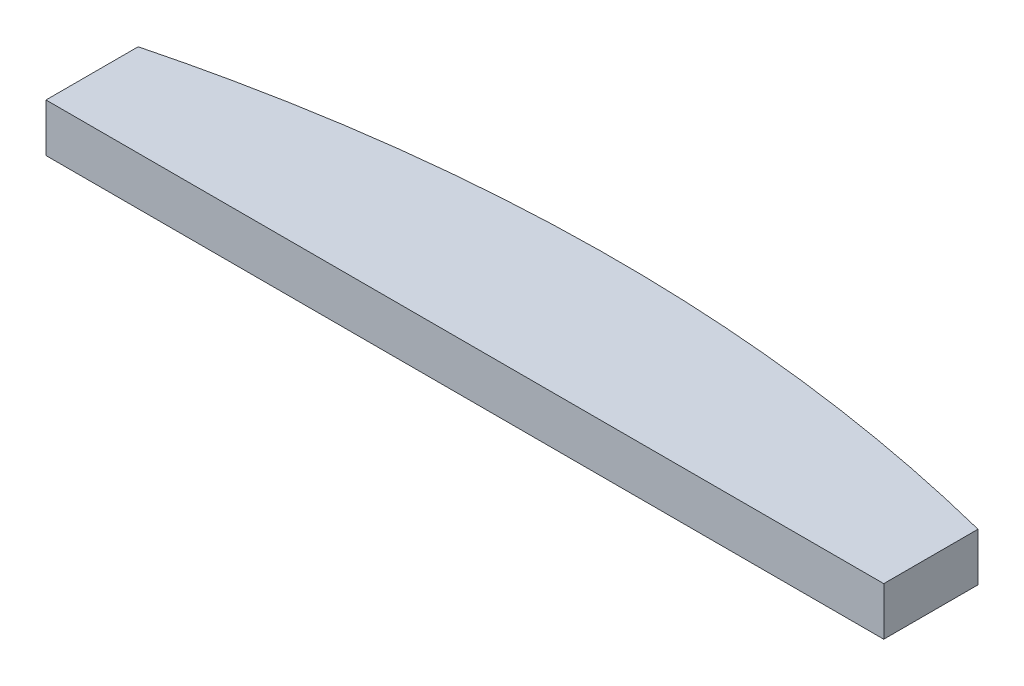
ISO-10303-21;
HEADER;
FILE_DESCRIPTION(('STEP AP214'),'2;1');
FILE_NAME('part.step','',(''),(''),'','','');
FILE_SCHEMA(('AUTOMOTIVE_DESIGN { 1 0 10303 214 1 1 1 1 }'));
ENDSEC;
DATA;
#1=APPLICATION_CONTEXT('core data for automotive mechanical design processes');
#2=APPLICATION_PROTOCOL_DEFINITION('international standard','automotive_design',2000,#1);
#3=PRODUCT_CONTEXT('',#1,'mechanical');
#4=PRODUCT('Part','Part','',(#3));
#5=PRODUCT_RELATED_PRODUCT_CATEGORY('part','',(#4));
#6=PRODUCT_DEFINITION_FORMATION('','',#4);
#7=PRODUCT_DEFINITION_CONTEXT('part definition',#1,'design');
#8=PRODUCT_DEFINITION('design','',#6,#7);
#9=PRODUCT_DEFINITION_SHAPE('','',#8);
#10=(LENGTH_UNIT() NAMED_UNIT(*) SI_UNIT(.MILLI.,.METRE.));
#11=(NAMED_UNIT(*) PLANE_ANGLE_UNIT() SI_UNIT($,.RADIAN.));
#12=(NAMED_UNIT(*) SI_UNIT($,.STERADIAN.) SOLID_ANGLE_UNIT());
#13=UNCERTAINTY_MEASURE_WITH_UNIT(LENGTH_MEASURE(1.E-05),#10,'distance_accuracy_value','');
#14=(GEOMETRIC_REPRESENTATION_CONTEXT(3) GLOBAL_UNCERTAINTY_ASSIGNED_CONTEXT((#13)) GLOBAL_UNIT_ASSIGNED_CONTEXT((#10,
#11,#12)) REPRESENTATION_CONTEXT('',''));
#15=CARTESIAN_POINT('',(0.,0.,0.));
#16=DIRECTION('',(0.,0.,1.));
#17=DIRECTION('',(1.,0.,0.));
#18=AXIS2_PLACEMENT_3D('',#15,#16,#17);
#19=CARTESIAN_POINT('',(-187.80820486291,2.921,-68.9201978060008));
#20=DIRECTION('',(0.,1.,0.));
#21=DIRECTION('',(0.,0.,1.));
#22=AXIS2_PLACEMENT_3D('',#19,#20,#21);
#23=PLANE('',#22);
#24=DIRECTION('',(0.,0.,1.));
#25=VECTOR('',#24,1.);
#26=CARTESIAN_POINT('',(-213.200238169666,2.921,-60.0302174041435));
#27=LINE('',#26,#25);
#28=CARTESIAN_POINT('',(-213.200238169666,2.921,-65.6182174041435));
#29=VERTEX_POINT('',#28);
#30=CARTESIAN_POINT('',(-213.200238169666,2.921,-60.0302174041435));
#31=VERTEX_POINT('',#30);
#32=EDGE_CURVE('E13',#29,#31,#27,.T.);
#33=ORIENTED_EDGE('',*,*,#32,.T.);
#34=DIRECTION('',(1.,0.,0.));
#35=VECTOR('',#34,1.);
#36=CARTESIAN_POINT('',(-213.200238169666,2.921,-60.0302174041435));
#37=LINE('',#36,#35);
#38=CARTESIAN_POINT('',(-162.400238169666,2.921,-60.0302174041435));
#39=VERTEX_POINT('',#38);
#40=EDGE_CURVE('E82',#31,#39,#37,.T.);
#41=ORIENTED_EDGE('',*,*,#40,.T.);
#42=DIRECTION('',(0.,0.,-1.));
#43=VECTOR('',#42,1.);
#44=CARTESIAN_POINT('',(-162.400238169666,2.921,-60.0302174041435));
#45=LINE('',#44,#43);
#46=CARTESIAN_POINT('',(-162.400238169666,2.921,-65.7452174041435));
#47=VERTEX_POINT('',#46);
#48=EDGE_CURVE('E123',#39,#47,#45,.T.);
#49=ORIENTED_EDGE('',*,*,#48,.T.);
#50=CARTESIAN_POINT('',(-162.400238169666,2.921,-65.7452174041435));
#51=CARTESIAN_POINT('',(-187.816171556154,2.921,-72.158678207858));
#52=CARTESIAN_POINT('',(-213.200238169666,2.921,-65.6182174041436));
#53=B_SPLINE_CURVE_WITH_KNOTS('',2,(#50,#51,#52),.UNSPECIFIED.,.F.,.F.,(3,3),(0.,1.),.UNSPECIFIED.);
#54=EDGE_CURVE('E145',#47,#29,#53,.T.);
#55=ORIENTED_EDGE('',*,*,#54,.T.);
#56=EDGE_LOOP('',(#33,#41,#49,#55));
#57=FACE_BOUND('',#56,.T.);
#58=ADVANCED_FACE('F73',(#57),#23,.T.);
#59=CARTESIAN_POINT('',(-213.200238169666,0.,-65.6182174041436));
#60=CARTESIAN_POINT('',(-187.816171556154,0.,-72.158678207858));
#61=CARTESIAN_POINT('',(-162.400238169666,0.,-65.7452174041435));
#62=B_SPLINE_CURVE_WITH_KNOTS('',2,(#59,#60,#61),.UNSPECIFIED.,.F.,.F.,(3,3),(0.,1.),.UNSPECIFIED.);
#63=DIRECTION('',(0.,1.,0.));
#64=VECTOR('',#63,1.);
#65=SURFACE_OF_LINEAR_EXTRUSION('',#62,#64);
#66=ORIENTED_EDGE('',*,*,#54,.F.);
#67=DIRECTION('',(0.,1.,0.));
#68=VECTOR('',#67,1.);
#69=CARTESIAN_POINT('',(-162.400238169666,0.,-65.7452174041435));
#70=LINE('',#69,#68);
#71=CARTESIAN_POINT('',(-162.400238169666,0.,-65.7452174041435));
#72=VERTEX_POINT('',#71);
#73=EDGE_CURVE('E127',#72,#47,#70,.T.);
#74=ORIENTED_EDGE('',*,*,#73,.F.);
#75=CARTESIAN_POINT('',(-213.200238169666,0.,-65.6182174041435));
#76=VERTEX_POINT('',#75);
#77=EDGE_CURVE('E89',#76,#72,#62,.T.);
#78=ORIENTED_EDGE('',*,*,#77,.F.);
#79=DIRECTION('',(0.,1.,0.));
#80=VECTOR('',#79,1.);
#81=CARTESIAN_POINT('',(-213.200238169666,0.,-65.6182174041435));
#82=LINE('',#81,#80);
#83=EDGE_CURVE('E138',#76,#29,#82,.T.);
#84=ORIENTED_EDGE('',*,*,#83,.T.);
#85=EDGE_LOOP('',(#66,#74,#78,#84));
#86=FACE_BOUND('',#85,.T.);
#87=ADVANCED_FACE('F161',(#86),#65,.F.);
#88=CARTESIAN_POINT('',(-162.400238169666,0.,0.));
#89=DIRECTION('',(1.,0.,0.));
#90=DIRECTION('',(0.,0.,-1.));
#91=AXIS2_PLACEMENT_3D('',#88,#89,#90);
#92=PLANE('',#91);
#93=DIRECTION('',(0.,1.,0.));
#94=VECTOR('',#93,1.);
#95=CARTESIAN_POINT('',(-162.400238169666,0.,-60.0302174041435));
#96=LINE('',#95,#94);
#97=CARTESIAN_POINT('',(-162.400238169666,0.,-60.0302174041435));
#98=VERTEX_POINT('',#97);
#99=EDGE_CURVE('E116',#98,#39,#96,.T.);
#100=ORIENTED_EDGE('',*,*,#99,.F.);
#101=DIRECTION('',(0.,0.,-1.));
#102=VECTOR('',#101,1.);
#103=CARTESIAN_POINT('',(-162.400238169666,0.,0.));
#104=LINE('',#103,#102);
#105=EDGE_CURVE('E121',#98,#72,#104,.T.);
#106=ORIENTED_EDGE('',*,*,#105,.T.);
#107=ORIENTED_EDGE('',*,*,#73,.T.);
#108=ORIENTED_EDGE('',*,*,#48,.F.);
#109=EDGE_LOOP('',(#100,#106,#107,#108));
#110=FACE_BOUND('',#109,.T.);
#111=ADVANCED_FACE('F118',(#110),#92,.T.);
#112=CARTESIAN_POINT('',(0.,0.,-60.0302174041435));
#113=DIRECTION('',(0.,0.,1.));
#114=DIRECTION('',(1.,0.,0.));
#115=AXIS2_PLACEMENT_3D('',#112,#113,#114);
#116=PLANE('',#115);
#117=DIRECTION('',(0.,1.,0.));
#118=VECTOR('',#117,1.);
#119=CARTESIAN_POINT('',(-213.200238169666,0.,-60.0302174041435));
#120=LINE('',#119,#118);
#121=CARTESIAN_POINT('',(-213.200238169666,0.,-60.0302174041435));
#122=VERTEX_POINT('',#121);
#123=EDGE_CURVE('E97',#122,#31,#120,.T.);
#124=ORIENTED_EDGE('',*,*,#123,.F.);
#125=DIRECTION('',(1.,0.,0.));
#126=VECTOR('',#125,1.);
#127=CARTESIAN_POINT('',(0.,0.,-60.0302174041435));
#128=LINE('',#127,#126);
#129=EDGE_CURVE('E130',#122,#98,#128,.T.);
#130=ORIENTED_EDGE('',*,*,#129,.T.);
#131=ORIENTED_EDGE('',*,*,#99,.T.);
#132=ORIENTED_EDGE('',*,*,#40,.F.);
#133=EDGE_LOOP('',(#124,#130,#131,#132));
#134=FACE_BOUND('',#133,.T.);
#135=ADVANCED_FACE('F131',(#134),#116,.T.);
#136=CARTESIAN_POINT('',(-213.200238169666,0.,0.));
#137=DIRECTION('',(1.,0.,0.));
#138=DIRECTION('',(0.,0.,-1.));
#139=AXIS2_PLACEMENT_3D('',#136,#137,#138);
#140=PLANE('',#139);
#141=ORIENTED_EDGE('',*,*,#32,.F.);
#142=ORIENTED_EDGE('',*,*,#83,.F.);
#143=DIRECTION('',(0.,0.,-1.));
#144=VECTOR('',#143,1.);
#145=CARTESIAN_POINT('',(-213.200238169666,0.,0.));
#146=LINE('',#145,#144);
#147=EDGE_CURVE('E135',#122,#76,#146,.T.);
#148=ORIENTED_EDGE('',*,*,#147,.F.);
#149=ORIENTED_EDGE('',*,*,#123,.T.);
#150=EDGE_LOOP('',(#141,#142,#148,#149));
#151=FACE_BOUND('',#150,.T.);
#152=ADVANCED_FACE('F160',(#151),#140,.F.);
#153=CARTESIAN_POINT('',(0.,0.,0.));
#154=DIRECTION('',(0.,1.,0.));
#155=DIRECTION('',(0.,0.,1.));
#156=AXIS2_PLACEMENT_3D('',#153,#154,#155);
#157=PLANE('',#156);
#158=ORIENTED_EDGE('',*,*,#147,.T.);
#159=ORIENTED_EDGE('',*,*,#77,.T.);
#160=ORIENTED_EDGE('',*,*,#105,.F.);
#161=ORIENTED_EDGE('',*,*,#129,.F.);
#162=EDGE_LOOP('',(#158,#159,#160,#161));
#163=FACE_BOUND('',#162,.T.);
#164=ADVANCED_FACE('F75',(#163),#157,.F.);
#165=CLOSED_SHELL('',(#58,#87,#111,#135,#152,#164));
#166=MANIFOLD_SOLID_BREP('B2',#165);
#167=ADVANCED_BREP_SHAPE_REPRESENTATION('',(#18,#166),#14);
#168=SHAPE_DEFINITION_REPRESENTATION(#9,#167);
ENDSEC;
END-ISO-10303-21;
